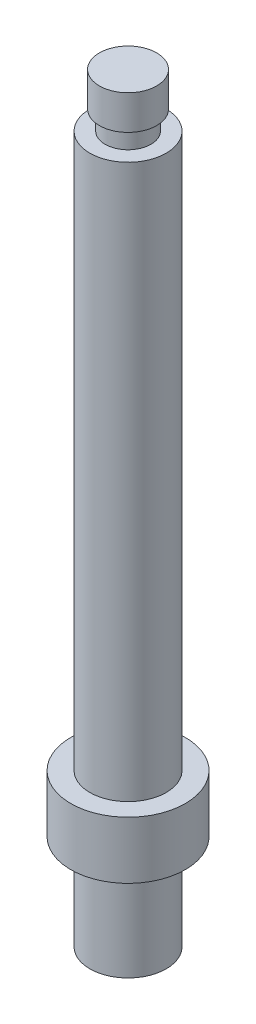
ISO-10303-21;
HEADER;
FILE_DESCRIPTION(('STEP AP214'),'2;1');
FILE_NAME('part.step','',(''),(''),'','','');
FILE_SCHEMA(('AUTOMOTIVE_DESIGN { 1 0 10303 214 1 1 1 1 }'));
ENDSEC;
DATA;
#1=APPLICATION_CONTEXT('core data for automotive mechanical design processes');
#2=APPLICATION_PROTOCOL_DEFINITION('international standard','automotive_design',2000,#1);
#3=PRODUCT_CONTEXT('',#1,'mechanical');
#4=PRODUCT('Part','Part','',(#3));
#5=PRODUCT_RELATED_PRODUCT_CATEGORY('part','',(#4));
#6=PRODUCT_DEFINITION_FORMATION('','',#4);
#7=PRODUCT_DEFINITION_CONTEXT('part definition',#1,'design');
#8=PRODUCT_DEFINITION('design','',#6,#7);
#9=PRODUCT_DEFINITION_SHAPE('','',#8);
#10=(LENGTH_UNIT() NAMED_UNIT(*) SI_UNIT(.MILLI.,.METRE.));
#11=(NAMED_UNIT(*) PLANE_ANGLE_UNIT() SI_UNIT($,.RADIAN.));
#12=(NAMED_UNIT(*) SI_UNIT($,.STERADIAN.) SOLID_ANGLE_UNIT());
#13=UNCERTAINTY_MEASURE_WITH_UNIT(LENGTH_MEASURE(1.E-05),#10,'distance_accuracy_value','');
#14=(GEOMETRIC_REPRESENTATION_CONTEXT(3) GLOBAL_UNCERTAINTY_ASSIGNED_CONTEXT((#13)) GLOBAL_UNIT_ASSIGNED_CONTEXT((#10,
#11,#12)) REPRESENTATION_CONTEXT('',''));
#15=CARTESIAN_POINT('',(0.,0.,0.));
#16=DIRECTION('',(0.,0.,1.));
#17=DIRECTION('',(1.,0.,0.));
#18=AXIS2_PLACEMENT_3D('',#15,#16,#17);
#19=CARTESIAN_POINT('',(0.,0.,0.));
#20=DIRECTION('',(0.,-1.,0.));
#21=DIRECTION('',(1.,0.,0.));
#22=AXIS2_PLACEMENT_3D('',#19,#20,#21);
#23=PLANE('',#22);
#24=CARTESIAN_POINT('',(1.5,0.,0.));
#25=DIRECTION('',(0.,-1.,0.));
#26=DIRECTION('',(1.,0.,0.));
#27=AXIS2_PLACEMENT_3D('',#24,#25,#26);
#28=CIRCLE('',#27,2.);
#29=CARTESIAN_POINT('',(3.5,0.,0.));
#30=VERTEX_POINT('',#29);
#31=EDGE_CURVE('E11',#30,#30,#28,.T.);
#32=ORIENTED_EDGE('',*,*,#31,.F.);
#33=EDGE_LOOP('',(#32));
#34=FACE_BOUND('',#33,.T.);
#35=CARTESIAN_POINT('',(1.5,0.,0.));
#36=DIRECTION('',(0.,-1.,0.));
#37=DIRECTION('',(1.,0.,0.));
#38=AXIS2_PLACEMENT_3D('',#35,#36,#37);
#39=CIRCLE('',#38,1.2);
#40=CARTESIAN_POINT('',(2.7,0.,0.));
#41=VERTEX_POINT('',#40);
#42=EDGE_CURVE('E61',#41,#41,#39,.T.);
#43=ORIENTED_EDGE('',*,*,#42,.T.);
#44=EDGE_LOOP('',(#43));
#45=FACE_BOUND('',#44,.T.);
#46=ADVANCED_FACE('F40',(#34,#45),#23,.F.);
#47=CARTESIAN_POINT('',(1.5,-37.,0.));
#48=DIRECTION('',(0.,-1.,0.));
#49=DIRECTION('',(1.,0.,0.));
#50=AXIS2_PLACEMENT_3D('',#47,#48,#49);
#51=CYLINDRICAL_SURFACE('',#50,2.);
#52=CARTESIAN_POINT('',(1.5,-29.,0.));
#53=DIRECTION('',(0.,-1.,0.));
#54=DIRECTION('',(1.,0.,0.));
#55=AXIS2_PLACEMENT_3D('',#52,#53,#54);
#56=CIRCLE('',#55,2.);
#57=CARTESIAN_POINT('',(3.5,-29.,0.));
#58=VERTEX_POINT('',#57);
#59=EDGE_CURVE('E47',#58,#58,#56,.T.);
#60=ORIENTED_EDGE('',*,*,#59,.F.);
#61=EDGE_LOOP('',(#60));
#62=FACE_BOUND('',#61,.T.);
#63=ORIENTED_EDGE('',*,*,#31,.T.);
#64=EDGE_LOOP('',(#63));
#65=FACE_BOUND('',#64,.T.);
#66=ADVANCED_FACE('F108',(#62,#65),#51,.T.);
#67=CARTESIAN_POINT('',(-0.499999999999996,-29.,0.));
#68=DIRECTION('',(0.,-1.,0.));
#69=DIRECTION('',(1.,0.,0.));
#70=AXIS2_PLACEMENT_3D('',#67,#68,#69);
#71=PLANE('',#70);
#72=CARTESIAN_POINT('',(1.5,-29.,0.));
#73=DIRECTION('',(0.,-1.,0.));
#74=DIRECTION('',(1.,0.,0.));
#75=AXIS2_PLACEMENT_3D('',#72,#73,#74);
#76=CIRCLE('',#75,3.);
#77=CARTESIAN_POINT('',(4.5,-29.,0.));
#78=VERTEX_POINT('',#77);
#79=EDGE_CURVE('E98',#78,#78,#76,.T.);
#80=ORIENTED_EDGE('',*,*,#79,.F.);
#81=EDGE_LOOP('',(#80));
#82=FACE_BOUND('',#81,.T.);
#83=ORIENTED_EDGE('',*,*,#59,.T.);
#84=EDGE_LOOP('',(#83));
#85=FACE_BOUND('',#84,.T.);
#86=ADVANCED_FACE('F106',(#82,#85),#71,.F.);
#87=CARTESIAN_POINT('',(1.5,-37.,0.));
#88=DIRECTION('',(0.,-1.,0.));
#89=DIRECTION('',(1.,0.,0.));
#90=AXIS2_PLACEMENT_3D('',#87,#88,#89);
#91=CYLINDRICAL_SURFACE('',#90,3.);
#92=CARTESIAN_POINT('',(1.5,-32.,0.));
#93=DIRECTION('',(0.,-1.,0.));
#94=DIRECTION('',(1.,0.,0.));
#95=AXIS2_PLACEMENT_3D('',#92,#93,#94);
#96=CIRCLE('',#95,3.);
#97=CARTESIAN_POINT('',(4.5,-32.,0.));
#98=VERTEX_POINT('',#97);
#99=EDGE_CURVE('E94',#98,#98,#96,.T.);
#100=ORIENTED_EDGE('',*,*,#99,.F.);
#101=EDGE_LOOP('',(#100));
#102=FACE_BOUND('',#101,.T.);
#103=ORIENTED_EDGE('',*,*,#79,.T.);
#104=EDGE_LOOP('',(#103));
#105=FACE_BOUND('',#104,.T.);
#106=ADVANCED_FACE('F151',(#102,#105),#91,.T.);
#107=CARTESIAN_POINT('',(-1.5,-32.,0.));
#108=DIRECTION('',(0.,1.,0.));
#109=DIRECTION('',(-1.,0.,0.));
#110=AXIS2_PLACEMENT_3D('',#107,#108,#109);
#111=PLANE('',#110);
#112=CARTESIAN_POINT('',(1.5,-32.,0.));
#113=DIRECTION('',(0.,-1.,0.));
#114=DIRECTION('',(1.,0.,0.));
#115=AXIS2_PLACEMENT_3D('',#112,#113,#114);
#116=CIRCLE('',#115,2.);
#117=CARTESIAN_POINT('',(3.5,-32.,0.));
#118=VERTEX_POINT('',#117);
#119=EDGE_CURVE('E90',#118,#118,#116,.T.);
#120=ORIENTED_EDGE('',*,*,#119,.F.);
#121=EDGE_LOOP('',(#120));
#122=FACE_BOUND('',#121,.T.);
#123=ORIENTED_EDGE('',*,*,#99,.T.);
#124=EDGE_LOOP('',(#123));
#125=FACE_BOUND('',#124,.T.);
#126=ADVANCED_FACE('F147',(#122,#125),#111,.F.);
#127=CARTESIAN_POINT('',(1.5,-37.,0.));
#128=DIRECTION('',(0.,-1.,0.));
#129=DIRECTION('',(1.,0.,0.));
#130=AXIS2_PLACEMENT_3D('',#127,#128,#129);
#131=CYLINDRICAL_SURFACE('',#130,2.);
#132=CARTESIAN_POINT('',(1.5,-37.,0.));
#133=DIRECTION('',(0.,-1.,0.));
#134=DIRECTION('',(1.,0.,0.));
#135=AXIS2_PLACEMENT_3D('',#132,#133,#134);
#136=CIRCLE('',#135,2.);
#137=CARTESIAN_POINT('',(3.5,-37.,0.));
#138=VERTEX_POINT('',#137);
#139=EDGE_CURVE('E86',#138,#138,#136,.T.);
#140=ORIENTED_EDGE('',*,*,#139,.F.);
#141=EDGE_LOOP('',(#140));
#142=FACE_BOUND('',#141,.T.);
#143=ORIENTED_EDGE('',*,*,#119,.T.);
#144=EDGE_LOOP('',(#143));
#145=FACE_BOUND('',#144,.T.);
#146=ADVANCED_FACE('F141',(#142,#145),#131,.T.);
#147=CARTESIAN_POINT('',(1.5,-37.,0.));
#148=DIRECTION('',(0.,1.,0.));
#149=DIRECTION('',(-1.,0.,0.));
#150=AXIS2_PLACEMENT_3D('',#147,#148,#149);
#151=PLANE('',#150);
#152=CARTESIAN_POINT('',(1.5,-37.,0.));
#153=DIRECTION('',(0.,-1.,0.));
#154=DIRECTION('',(0.,0.,-1.));
#155=AXIS2_PLACEMENT_3D('',#152,#153,#154);
#156=CIRCLE('',#155,1.525);
#157=CARTESIAN_POINT('',(1.5,-37.,-1.52500000000003));
#158=VERTEX_POINT('',#157);
#159=EDGE_CURVE('E71',#158,#158,#156,.T.);
#160=ORIENTED_EDGE('',*,*,#159,.F.);
#161=EDGE_LOOP('',(#160));
#162=FACE_BOUND('',#161,.T.);
#163=ORIENTED_EDGE('',*,*,#139,.T.);
#164=EDGE_LOOP('',(#163));
#165=FACE_BOUND('',#164,.T.);
#166=ADVANCED_FACE('F136',(#162,#165),#151,.F.);
#167=CARTESIAN_POINT('',(0.,2.8,0.));
#168=DIRECTION('',(0.,-1.,0.));
#169=DIRECTION('',(1.,0.,0.));
#170=AXIS2_PLACEMENT_3D('',#167,#168,#169);
#171=PLANE('',#170);
#172=CARTESIAN_POINT('',(1.5,2.8,0.));
#173=DIRECTION('',(0.,-1.,0.));
#174=DIRECTION('',(1.,0.,0.));
#175=AXIS2_PLACEMENT_3D('',#172,#173,#174);
#176=CIRCLE('',#175,1.5);
#177=CARTESIAN_POINT('',(3.,2.8,0.));
#178=VERTEX_POINT('',#177);
#179=EDGE_CURVE('E82',#178,#178,#176,.T.);
#180=ORIENTED_EDGE('',*,*,#179,.F.);
#181=EDGE_LOOP('',(#180));
#182=FACE_BOUND('',#181,.T.);
#183=ADVANCED_FACE('F131',(#182),#171,.F.);
#184=CARTESIAN_POINT('',(1.5,-37.,0.));
#185=DIRECTION('',(0.,-1.,0.));
#186=DIRECTION('',(1.,0.,0.));
#187=AXIS2_PLACEMENT_3D('',#184,#185,#186);
#188=CYLINDRICAL_SURFACE('',#187,1.5);
#189=CARTESIAN_POINT('',(1.5,1.,0.));
#190=DIRECTION('',(0.,-1.,0.));
#191=DIRECTION('',(1.,0.,0.));
#192=AXIS2_PLACEMENT_3D('',#189,#190,#191);
#193=CIRCLE('',#192,1.5);
#194=CARTESIAN_POINT('',(3.,1.,0.));
#195=VERTEX_POINT('',#194);
#196=EDGE_CURVE('E78',#195,#195,#193,.T.);
#197=ORIENTED_EDGE('',*,*,#196,.F.);
#198=EDGE_LOOP('',(#197));
#199=FACE_BOUND('',#198,.T.);
#200=ORIENTED_EDGE('',*,*,#179,.T.);
#201=EDGE_LOOP('',(#200));
#202=FACE_BOUND('',#201,.T.);
#203=ADVANCED_FACE('F125',(#199,#202),#188,.T.);
#204=CARTESIAN_POINT('',(0.3,1.,0.));
#205=DIRECTION('',(0.,1.,0.));
#206=DIRECTION('',(-1.,0.,0.));
#207=AXIS2_PLACEMENT_3D('',#204,#205,#206);
#208=PLANE('',#207);
#209=CARTESIAN_POINT('',(1.5,1.,0.));
#210=DIRECTION('',(0.,-1.,0.));
#211=DIRECTION('',(1.,0.,0.));
#212=AXIS2_PLACEMENT_3D('',#209,#210,#211);
#213=CIRCLE('',#212,1.2);
#214=CARTESIAN_POINT('',(2.7,1.,0.));
#215=VERTEX_POINT('',#214);
#216=EDGE_CURVE('E68',#215,#215,#213,.T.);
#217=ORIENTED_EDGE('',*,*,#216,.F.);
#218=EDGE_LOOP('',(#217));
#219=FACE_BOUND('',#218,.T.);
#220=ORIENTED_EDGE('',*,*,#196,.T.);
#221=EDGE_LOOP('',(#220));
#222=FACE_BOUND('',#221,.T.);
#223=ADVANCED_FACE('F119',(#219,#222),#208,.F.);
#224=CARTESIAN_POINT('',(1.5,-37.,0.));
#225=DIRECTION('',(0.,-1.,0.));
#226=DIRECTION('',(1.,0.,0.));
#227=AXIS2_PLACEMENT_3D('',#224,#225,#226);
#228=CYLINDRICAL_SURFACE('',#227,1.2);
#229=ORIENTED_EDGE('',*,*,#42,.F.);
#230=EDGE_LOOP('',(#229));
#231=FACE_BOUND('',#230,.T.);
#232=ORIENTED_EDGE('',*,*,#216,.T.);
#233=EDGE_LOOP('',(#232));
#234=FACE_BOUND('',#233,.T.);
#235=ADVANCED_FACE('F54',(#231,#234),#228,.T.);
#236=CARTESIAN_POINT('',(1.5,-28.5,0.));
#237=DIRECTION('',(0.,-1.,0.));
#238=DIRECTION('',(0.,0.,-1.));
#239=AXIS2_PLACEMENT_3D('',#236,#237,#238);
#240=CONICAL_SURFACE('',#239,1.24999999999999,1.02974425867665);
#241=CARTESIAN_POINT('',(1.49999999999999,-27.7489242262156,0.));
#242=VERTEX_POINT('',#241);
#243=VERTEX_LOOP('',#242);
#244=FACE_BOUND('',#243,.T.);
#245=CARTESIAN_POINT('',(1.5,-28.5,0.));
#246=DIRECTION('',(0.,-1.,0.));
#247=DIRECTION('',(0.,0.,-1.));
#248=AXIS2_PLACEMENT_3D('',#245,#246,#247);
#249=CIRCLE('',#248,1.24999999999999);
#250=CARTESIAN_POINT('',(1.5,-28.5,-1.25000000000002));
#251=VERTEX_POINT('',#250);
#252=EDGE_CURVE('E58',#251,#251,#249,.T.);
#253=ORIENTED_EDGE('',*,*,#252,.T.);
#254=EDGE_LOOP('',(#253));
#255=FACE_BOUND('',#254,.T.);
#256=ADVANCED_FACE('F50',(#244,#255),#240,.F.);
#257=CARTESIAN_POINT('',(1.5,-37.,0.));
#258=DIRECTION('',(0.,-1.,0.));
#259=DIRECTION('',(0.,0.,-1.));
#260=AXIS2_PLACEMENT_3D('',#257,#258,#259);
#261=CYLINDRICAL_SURFACE('',#260,1.24999999999999);
#262=ORIENTED_EDGE('',*,*,#252,.F.);
#263=EDGE_LOOP('',(#262));
#264=FACE_BOUND('',#263,.T.);
#265=CARTESIAN_POINT('',(1.5,-36.725,0.));
#266=DIRECTION('',(0.,-1.,0.));
#267=DIRECTION('',(0.,0.,-1.));
#268=AXIS2_PLACEMENT_3D('',#265,#266,#267);
#269=CIRCLE('',#268,1.25);
#270=CARTESIAN_POINT('',(1.5,-36.725,-1.25000000000003));
#271=VERTEX_POINT('',#270);
#272=EDGE_CURVE('E62',#271,#271,#269,.T.);
#273=ORIENTED_EDGE('',*,*,#272,.T.);
#274=EDGE_LOOP('',(#273));
#275=FACE_BOUND('',#274,.T.);
#276=ADVANCED_FACE('F53',(#264,#275),#261,.F.);
#277=CARTESIAN_POINT('',(1.5,-37.,0.));
#278=DIRECTION('',(0.,-1.,0.));
#279=DIRECTION('',(0.,0.,-1.));
#280=AXIS2_PLACEMENT_3D('',#277,#278,#279);
#281=CONICAL_SURFACE('',#280,1.525,0.785398163397444);
#282=ORIENTED_EDGE('',*,*,#272,.F.);
#283=EDGE_LOOP('',(#282));
#284=FACE_BOUND('',#283,.T.);
#285=ORIENTED_EDGE('',*,*,#159,.T.);
#286=EDGE_LOOP('',(#285));
#287=FACE_BOUND('',#286,.T.);
#288=ADVANCED_FACE('F219',(#284,#287),#281,.F.);
#289=CLOSED_SHELL('',(#46,#66,#86,#106,#126,#146,#166,#183,#203,#223,#235,#256,#276,#288));
#290=MANIFOLD_SOLID_BREP('B2',#289);
#291=ADVANCED_BREP_SHAPE_REPRESENTATION('',(#18,#290),#14);
#292=SHAPE_DEFINITION_REPRESENTATION(#9,#291);
ENDSEC;
END-ISO-10303-21;
